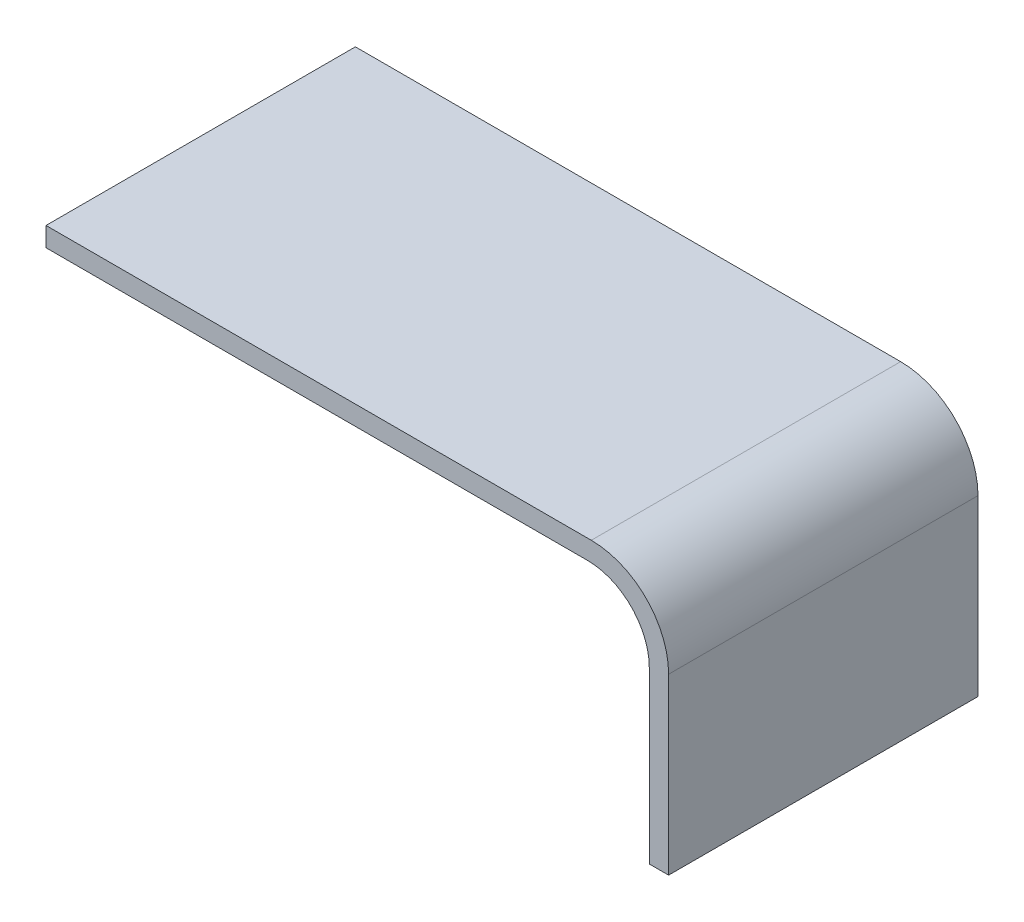
ISO-10303-21;
HEADER;
FILE_DESCRIPTION(('STEP AP214'),'2;1');
FILE_NAME('part.step','',(''),(''),'','','');
FILE_SCHEMA(('AUTOMOTIVE_DESIGN { 1 0 10303 214 1 1 1 1 }'));
ENDSEC;
DATA;
#1=APPLICATION_CONTEXT('core data for automotive mechanical design processes');
#2=APPLICATION_PROTOCOL_DEFINITION('international standard','automotive_design',2000,#1);
#3=PRODUCT_CONTEXT('',#1,'mechanical');
#4=PRODUCT('Part','Part','',(#3));
#5=PRODUCT_RELATED_PRODUCT_CATEGORY('part','',(#4));
#6=PRODUCT_DEFINITION_FORMATION('','',#4);
#7=PRODUCT_DEFINITION_CONTEXT('part definition',#1,'design');
#8=PRODUCT_DEFINITION('design','',#6,#7);
#9=PRODUCT_DEFINITION_SHAPE('','',#8);
#10=(LENGTH_UNIT() NAMED_UNIT(*) SI_UNIT(.MILLI.,.METRE.));
#11=(NAMED_UNIT(*) PLANE_ANGLE_UNIT() SI_UNIT($,.RADIAN.));
#12=(NAMED_UNIT(*) SI_UNIT($,.STERADIAN.) SOLID_ANGLE_UNIT());
#13=UNCERTAINTY_MEASURE_WITH_UNIT(LENGTH_MEASURE(1.E-05),#10,'distance_accuracy_value','');
#14=(GEOMETRIC_REPRESENTATION_CONTEXT(3) GLOBAL_UNCERTAINTY_ASSIGNED_CONTEXT((#13)) GLOBAL_UNIT_ASSIGNED_CONTEXT((#10,
#11,#12)) REPRESENTATION_CONTEXT('',''));
#15=CARTESIAN_POINT('',(0.,0.,0.));
#16=DIRECTION('',(0.,0.,1.));
#17=DIRECTION('',(1.,0.,0.));
#18=AXIS2_PLACEMENT_3D('',#15,#16,#17);
#19=CARTESIAN_POINT('',(204.47,0.,101.6));
#20=DIRECTION('',(1.,0.,0.));
#21=DIRECTION('',(0.,0.,-1.));
#22=AXIS2_PLACEMENT_3D('',#19,#20,#21);
#23=PLANE('',#22);
#24=DIRECTION('',(0.,-1.,0.));
#25=VECTOR('',#24,1.);
#26=CARTESIAN_POINT('',(204.47,0.,0.));
#27=LINE('',#26,#25);
#28=CARTESIAN_POINT('',(204.47,0.,0.));
#29=VERTEX_POINT('',#28);
#30=CARTESIAN_POINT('',(204.47,-6.35,0.));
#31=VERTEX_POINT('',#30);
#32=EDGE_CURVE('E139',#29,#31,#27,.T.);
#33=ORIENTED_EDGE('',*,*,#32,.T.);
#34=DIRECTION('',(0.,0.,-1.));
#35=VECTOR('',#34,1.);
#36=CARTESIAN_POINT('',(204.47,-6.35,101.6));
#37=LINE('',#36,#35);
#38=CARTESIAN_POINT('',(204.47,-6.35,101.6));
#39=VERTEX_POINT('',#38);
#40=EDGE_CURVE('E11',#39,#31,#37,.T.);
#41=ORIENTED_EDGE('',*,*,#40,.F.);
#42=DIRECTION('',(0.,-1.,0.));
#43=VECTOR('',#42,1.);
#44=CARTESIAN_POINT('',(204.47,0.,101.6));
#45=LINE('',#44,#43);
#46=CARTESIAN_POINT('',(204.47,0.,101.6));
#47=VERTEX_POINT('',#46);
#48=EDGE_CURVE('E153',#47,#39,#45,.T.);
#49=ORIENTED_EDGE('',*,*,#48,.F.);
#50=DIRECTION('',(0.,0.,-1.));
#51=VECTOR('',#50,1.);
#52=CARTESIAN_POINT('',(204.47,0.,101.6));
#53=LINE('',#52,#51);
#54=EDGE_CURVE('E135',#47,#29,#53,.T.);
#55=ORIENTED_EDGE('',*,*,#54,.T.);
#56=EDGE_LOOP('',(#33,#41,#49,#55));
#57=FACE_BOUND('',#56,.T.);
#58=ADVANCED_FACE('F43',(#57),#23,.F.);
#59=CARTESIAN_POINT('',(382.27,-6.35000000000002,101.6));
#60=DIRECTION('',(0.,1.,0.));
#61=DIRECTION('',(-1.,0.,0.));
#62=AXIS2_PLACEMENT_3D('',#59,#60,#61);
#63=PLANE('',#62);
#64=DIRECTION('',(1.,0.,0.));
#65=VECTOR('',#64,1.);
#66=CARTESIAN_POINT('',(382.27,-6.35000000000002,0.));
#67=LINE('',#66,#65);
#68=CARTESIAN_POINT('',(382.27,-6.34999999999999,0.));
#69=VERTEX_POINT('',#68);
#70=EDGE_CURVE('E142',#31,#69,#67,.T.);
#71=ORIENTED_EDGE('',*,*,#70,.T.);
#72=DIRECTION('',(0.,0.,-1.));
#73=VECTOR('',#72,1.);
#74=CARTESIAN_POINT('',(382.27,-6.34999999999999,101.6));
#75=LINE('',#74,#73);
#76=CARTESIAN_POINT('',(382.27,-6.34999999999999,101.6));
#77=VERTEX_POINT('',#76);
#78=EDGE_CURVE('E51',#77,#69,#75,.T.);
#79=ORIENTED_EDGE('',*,*,#78,.F.);
#80=DIRECTION('',(1.,0.,0.));
#81=VECTOR('',#80,1.);
#82=CARTESIAN_POINT('',(382.27,-6.35000000000002,101.6));
#83=LINE('',#82,#81);
#84=EDGE_CURVE('E102',#39,#77,#83,.T.);
#85=ORIENTED_EDGE('',*,*,#84,.F.);
#86=ORIENTED_EDGE('',*,*,#40,.T.);
#87=EDGE_LOOP('',(#71,#79,#85,#86));
#88=FACE_BOUND('',#87,.T.);
#89=ADVANCED_FACE('F188',(#88),#63,.F.);
#90=CARTESIAN_POINT('',(382.27,-26.67,101.6));
#91=DIRECTION('',(0.,0.,-1.));
#92=DIRECTION('',(-1.,0.,0.));
#93=AXIS2_PLACEMENT_3D('',#90,#91,#92);
#94=CYLINDRICAL_SURFACE('',#93,20.32);
#95=CARTESIAN_POINT('',(382.27,-26.67,0.));
#96=DIRECTION('',(0.,0.,-1.));
#97=DIRECTION('',(1.,0.,0.));
#98=AXIS2_PLACEMENT_3D('',#95,#96,#97);
#99=CIRCLE('',#98,20.32);
#100=CARTESIAN_POINT('',(402.59,-26.67,0.));
#101=VERTEX_POINT('',#100);
#102=EDGE_CURVE('E144',#69,#101,#99,.T.);
#103=ORIENTED_EDGE('',*,*,#102,.T.);
#104=DIRECTION('',(0.,0.,-1.));
#105=VECTOR('',#104,1.);
#106=CARTESIAN_POINT('',(402.59,-26.67,101.6));
#107=LINE('',#106,#105);
#108=CARTESIAN_POINT('',(402.59,-26.67,101.6));
#109=VERTEX_POINT('',#108);
#110=EDGE_CURVE('E160',#109,#101,#107,.T.);
#111=ORIENTED_EDGE('',*,*,#110,.F.);
#112=CARTESIAN_POINT('',(382.27,-26.67,101.6));
#113=DIRECTION('',(0.,0.,-1.));
#114=DIRECTION('',(1.,0.,0.));
#115=AXIS2_PLACEMENT_3D('',#112,#113,#114);
#116=CIRCLE('',#115,20.32);
#117=EDGE_CURVE('E168',#77,#109,#116,.T.);
#118=ORIENTED_EDGE('',*,*,#117,.F.);
#119=ORIENTED_EDGE('',*,*,#78,.T.);
#120=EDGE_LOOP('',(#103,#111,#118,#119));
#121=FACE_BOUND('',#120,.T.);
#122=ADVANCED_FACE('F166',(#121),#94,.F.);
#123=CARTESIAN_POINT('',(402.59,-26.67,101.6));
#124=DIRECTION('',(1.,0.,0.));
#125=DIRECTION('',(0.,1.,0.));
#126=AXIS2_PLACEMENT_3D('',#123,#124,#125);
#127=PLANE('',#126);
#128=DIRECTION('',(0.,-1.,0.));
#129=VECTOR('',#128,1.);
#130=CARTESIAN_POINT('',(402.59,-26.67,0.));
#131=LINE('',#130,#129);
#132=CARTESIAN_POINT('',(402.59,-82.55,0.));
#133=VERTEX_POINT('',#132);
#134=EDGE_CURVE('E146',#101,#133,#131,.T.);
#135=ORIENTED_EDGE('',*,*,#134,.T.);
#136=DIRECTION('',(0.,0.,-1.));
#137=VECTOR('',#136,1.);
#138=CARTESIAN_POINT('',(402.59,-82.55,101.6));
#139=LINE('',#138,#137);
#140=CARTESIAN_POINT('',(402.59,-82.55,101.6));
#141=VERTEX_POINT('',#140);
#142=EDGE_CURVE('E157',#141,#133,#139,.T.);
#143=ORIENTED_EDGE('',*,*,#142,.F.);
#144=DIRECTION('',(0.,-1.,0.));
#145=VECTOR('',#144,1.);
#146=CARTESIAN_POINT('',(402.59,-26.67,101.6));
#147=LINE('',#146,#145);
#148=EDGE_CURVE('E180',#109,#141,#147,.T.);
#149=ORIENTED_EDGE('',*,*,#148,.F.);
#150=ORIENTED_EDGE('',*,*,#110,.T.);
#151=EDGE_LOOP('',(#135,#143,#149,#150));
#152=FACE_BOUND('',#151,.T.);
#153=ADVANCED_FACE('F176',(#152),#127,.F.);
#154=CARTESIAN_POINT('',(402.59,-82.55,101.6));
#155=DIRECTION('',(0.,1.,0.));
#156=DIRECTION('',(0.,0.,1.));
#157=AXIS2_PLACEMENT_3D('',#154,#155,#156);
#158=PLANE('',#157);
#159=DIRECTION('',(1.,0.,0.));
#160=VECTOR('',#159,1.);
#161=CARTESIAN_POINT('',(402.59,-82.55,0.));
#162=LINE('',#161,#160);
#163=CARTESIAN_POINT('',(408.94,-82.55,0.));
#164=VERTEX_POINT('',#163);
#165=EDGE_CURVE('E148',#133,#164,#162,.T.);
#166=ORIENTED_EDGE('',*,*,#165,.T.);
#167=DIRECTION('',(0.,0.,-1.));
#168=VECTOR('',#167,1.);
#169=CARTESIAN_POINT('',(408.94,-82.55,101.6));
#170=LINE('',#169,#168);
#171=CARTESIAN_POINT('',(408.94,-82.55,101.6));
#172=VERTEX_POINT('',#171);
#173=EDGE_CURVE('E130',#172,#164,#170,.T.);
#174=ORIENTED_EDGE('',*,*,#173,.F.);
#175=DIRECTION('',(1.,0.,0.));
#176=VECTOR('',#175,1.);
#177=CARTESIAN_POINT('',(402.59,-82.55,101.6));
#178=LINE('',#177,#176);
#179=EDGE_CURVE('E121',#141,#172,#178,.T.);
#180=ORIENTED_EDGE('',*,*,#179,.F.);
#181=ORIENTED_EDGE('',*,*,#142,.T.);
#182=EDGE_LOOP('',(#166,#174,#180,#181));
#183=FACE_BOUND('',#182,.T.);
#184=ADVANCED_FACE('F179',(#183),#158,.F.);
#185=CARTESIAN_POINT('',(408.94,-82.55,101.6));
#186=DIRECTION('',(-1.,0.,0.));
#187=DIRECTION('',(0.,-1.,0.));
#188=AXIS2_PLACEMENT_3D('',#185,#186,#187);
#189=PLANE('',#188);
#190=DIRECTION('',(0.,1.,0.));
#191=VECTOR('',#190,1.);
#192=CARTESIAN_POINT('',(408.94,-82.55,0.));
#193=LINE('',#192,#191);
#194=CARTESIAN_POINT('',(408.94,-25.4000000000002,0.));
#195=VERTEX_POINT('',#194);
#196=EDGE_CURVE('E129',#164,#195,#193,.T.);
#197=ORIENTED_EDGE('',*,*,#196,.T.);
#198=DIRECTION('',(0.,0.,-1.));
#199=VECTOR('',#198,1.);
#200=CARTESIAN_POINT('',(408.94,-25.4000000000002,101.6));
#201=LINE('',#200,#199);
#202=CARTESIAN_POINT('',(408.94,-25.4000000000002,101.6));
#203=VERTEX_POINT('',#202);
#204=EDGE_CURVE('E126',#203,#195,#201,.T.);
#205=ORIENTED_EDGE('',*,*,#204,.F.);
#206=DIRECTION('',(0.,1.,0.));
#207=VECTOR('',#206,1.);
#208=CARTESIAN_POINT('',(408.94,-82.55,101.6));
#209=LINE('',#208,#207);
#210=EDGE_CURVE('E115',#172,#203,#209,.T.);
#211=ORIENTED_EDGE('',*,*,#210,.F.);
#212=ORIENTED_EDGE('',*,*,#173,.T.);
#213=EDGE_LOOP('',(#197,#205,#211,#212));
#214=FACE_BOUND('',#213,.T.);
#215=ADVANCED_FACE('F127',(#214),#189,.F.);
#216=CARTESIAN_POINT('',(383.54,-25.4,101.6));
#217=DIRECTION('',(0.,0.,-1.));
#218=DIRECTION('',(-1.,0.,0.));
#219=AXIS2_PLACEMENT_3D('',#216,#217,#218);
#220=CYLINDRICAL_SURFACE('',#219,25.4);
#221=CARTESIAN_POINT('',(383.54,-25.4,0.));
#222=DIRECTION('',(0.,0.,1.));
#223=DIRECTION('',(1.,0.,0.));
#224=AXIS2_PLACEMENT_3D('',#221,#222,#223);
#225=CIRCLE('',#224,25.4);
#226=CARTESIAN_POINT('',(383.54,0.,0.));
#227=VERTEX_POINT('',#226);
#228=EDGE_CURVE('E88',#195,#227,#225,.T.);
#229=ORIENTED_EDGE('',*,*,#228,.T.);
#230=DIRECTION('',(0.,0.,-1.));
#231=VECTOR('',#230,1.);
#232=CARTESIAN_POINT('',(383.54,0.,101.6));
#233=LINE('',#232,#231);
#234=CARTESIAN_POINT('',(383.54,0.,101.6));
#235=VERTEX_POINT('',#234);
#236=EDGE_CURVE('E131',#235,#227,#233,.T.);
#237=ORIENTED_EDGE('',*,*,#236,.F.);
#238=CARTESIAN_POINT('',(383.54,-25.4,101.6));
#239=DIRECTION('',(0.,0.,1.));
#240=DIRECTION('',(1.,0.,0.));
#241=AXIS2_PLACEMENT_3D('',#238,#239,#240);
#242=CIRCLE('',#241,25.4);
#243=EDGE_CURVE('E119',#203,#235,#242,.T.);
#244=ORIENTED_EDGE('',*,*,#243,.F.);
#245=ORIENTED_EDGE('',*,*,#204,.T.);
#246=EDGE_LOOP('',(#229,#237,#244,#245));
#247=FACE_BOUND('',#246,.T.);
#248=ADVANCED_FACE('F133',(#247),#220,.T.);
#249=CARTESIAN_POINT('',(204.47,0.,101.6));
#250=DIRECTION('',(0.,-1.,0.));
#251=DIRECTION('',(1.,0.,0.));
#252=AXIS2_PLACEMENT_3D('',#249,#250,#251);
#253=PLANE('',#252);
#254=DIRECTION('',(-1.,0.,0.));
#255=VECTOR('',#254,1.);
#256=CARTESIAN_POINT('',(204.47,0.,0.));
#257=LINE('',#256,#255);
#258=EDGE_CURVE('E94',#227,#29,#257,.T.);
#259=ORIENTED_EDGE('',*,*,#258,.T.);
#260=ORIENTED_EDGE('',*,*,#54,.F.);
#261=DIRECTION('',(-1.,0.,0.));
#262=VECTOR('',#261,1.);
#263=CARTESIAN_POINT('',(204.47,0.,101.6));
#264=LINE('',#263,#262);
#265=EDGE_CURVE('E59',#235,#47,#264,.T.);
#266=ORIENTED_EDGE('',*,*,#265,.F.);
#267=ORIENTED_EDGE('',*,*,#236,.T.);
#268=EDGE_LOOP('',(#259,#260,#266,#267));
#269=FACE_BOUND('',#268,.T.);
#270=ADVANCED_FACE('F204',(#269),#253,.F.);
#271=CARTESIAN_POINT('',(382.27,-26.67,101.6));
#272=DIRECTION('',(0.,0.,1.));
#273=DIRECTION('',(1.,0.,0.));
#274=AXIS2_PLACEMENT_3D('',#271,#272,#273);
#275=PLANE('',#274);
#276=ORIENTED_EDGE('',*,*,#48,.T.);
#277=ORIENTED_EDGE('',*,*,#84,.T.);
#278=ORIENTED_EDGE('',*,*,#117,.T.);
#279=ORIENTED_EDGE('',*,*,#148,.T.);
#280=ORIENTED_EDGE('',*,*,#179,.T.);
#281=ORIENTED_EDGE('',*,*,#210,.T.);
#282=ORIENTED_EDGE('',*,*,#243,.T.);
#283=ORIENTED_EDGE('',*,*,#265,.T.);
#284=EDGE_LOOP('',(#276,#277,#278,#279,#280,#281,#282,#283));
#285=FACE_BOUND('',#284,.T.);
#286=ADVANCED_FACE('F117',(#285),#275,.T.);
#287=CARTESIAN_POINT('',(382.27,-26.67,0.));
#288=DIRECTION('',(0.,0.,1.));
#289=DIRECTION('',(1.,0.,0.));
#290=AXIS2_PLACEMENT_3D('',#287,#288,#289);
#291=PLANE('',#290);
#292=ORIENTED_EDGE('',*,*,#32,.F.);
#293=ORIENTED_EDGE('',*,*,#258,.F.);
#294=ORIENTED_EDGE('',*,*,#228,.F.);
#295=ORIENTED_EDGE('',*,*,#196,.F.);
#296=ORIENTED_EDGE('',*,*,#165,.F.);
#297=ORIENTED_EDGE('',*,*,#134,.F.);
#298=ORIENTED_EDGE('',*,*,#102,.F.);
#299=ORIENTED_EDGE('',*,*,#70,.F.);
#300=EDGE_LOOP('',(#292,#293,#294,#295,#296,#297,#298,#299));
#301=FACE_BOUND('',#300,.T.);
#302=ADVANCED_FACE('F172',(#301),#291,.F.);
#303=CLOSED_SHELL('',(#58,#89,#122,#153,#184,#215,#248,#270,#286,#302));
#304=MANIFOLD_SOLID_BREP('B2',#303);
#305=ADVANCED_BREP_SHAPE_REPRESENTATION('',(#18,#304),#14);
#306=SHAPE_DEFINITION_REPRESENTATION(#9,#305);
ENDSEC;
END-ISO-10303-21;
